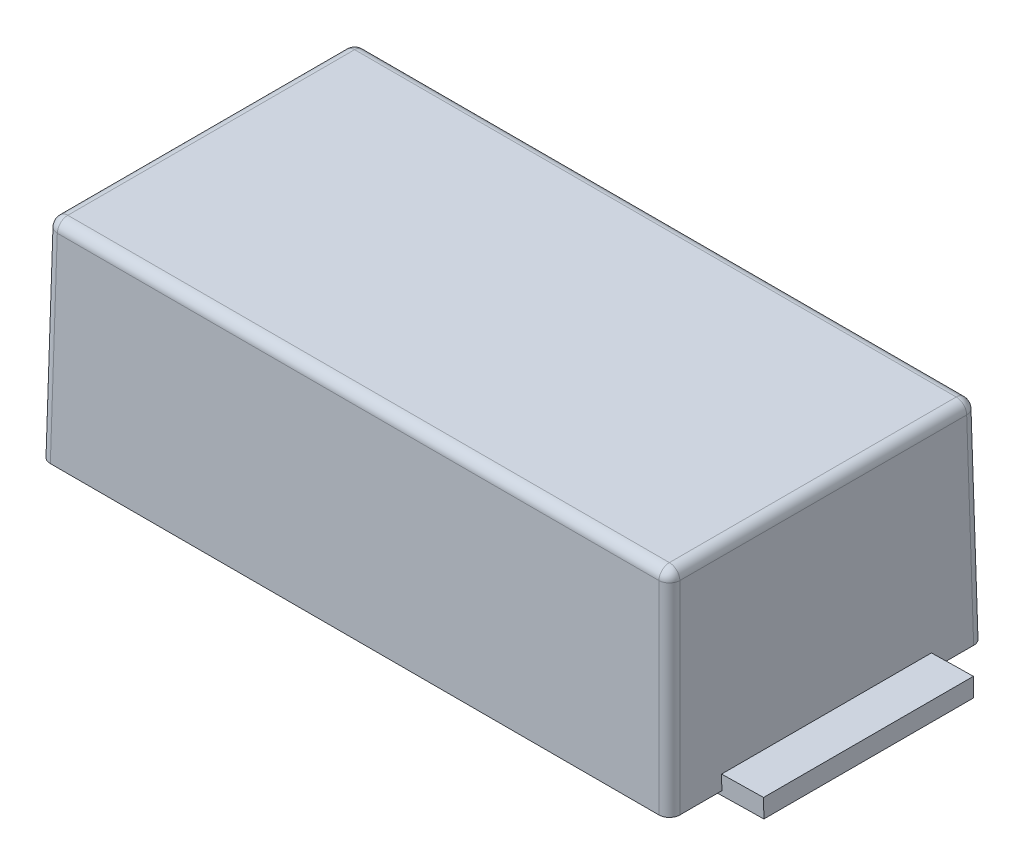
ISO-10303-21;
HEADER;
FILE_DESCRIPTION(('STEP AP214'),'2;1');
FILE_NAME('part.step','',(''),(''),'','','');
FILE_SCHEMA(('AUTOMOTIVE_DESIGN { 1 0 10303 214 1 1 1 1 }'));
ENDSEC;
DATA;
#1=APPLICATION_CONTEXT('core data for automotive mechanical design processes');
#2=APPLICATION_PROTOCOL_DEFINITION('international standard','automotive_design',2000,#1);
#3=PRODUCT_CONTEXT('',#1,'mechanical');
#4=PRODUCT('Part','Part','',(#3));
#5=PRODUCT_RELATED_PRODUCT_CATEGORY('part','',(#4));
#6=PRODUCT_DEFINITION_FORMATION('','',#4);
#7=PRODUCT_DEFINITION_CONTEXT('part definition',#1,'design');
#8=PRODUCT_DEFINITION('design','',#6,#7);
#9=PRODUCT_DEFINITION_SHAPE('','',#8);
#10=(LENGTH_UNIT() NAMED_UNIT(*) SI_UNIT(.MILLI.,.METRE.));
#11=(NAMED_UNIT(*) PLANE_ANGLE_UNIT() SI_UNIT($,.RADIAN.));
#12=(NAMED_UNIT(*) SI_UNIT($,.STERADIAN.) SOLID_ANGLE_UNIT());
#13=UNCERTAINTY_MEASURE_WITH_UNIT(LENGTH_MEASURE(1.E-05),#10,'distance_accuracy_value','');
#14=(GEOMETRIC_REPRESENTATION_CONTEXT(3) GLOBAL_UNCERTAINTY_ASSIGNED_CONTEXT((#13)) GLOBAL_UNIT_ASSIGNED_CONTEXT((#10,
#11,#12)) REPRESENTATION_CONTEXT('',''));
#15=CARTESIAN_POINT('',(0.,0.,0.));
#16=DIRECTION('',(0.,0.,1.));
#17=DIRECTION('',(1.,0.,0.));
#18=AXIS2_PLACEMENT_3D('',#15,#16,#17);
#19=CARTESIAN_POINT('',(0.,0.,0.));
#20=DIRECTION('',(0.,-1.,0.));
#21=DIRECTION('',(0.,0.,-1.));
#22=AXIS2_PLACEMENT_3D('',#19,#20,#21);
#23=PLANE('',#22);
#24=DIRECTION('',(0.,0.,1.));
#25=VECTOR('',#24,1.);
#26=CARTESIAN_POINT('',(-1.5,0.,0.75));
#27=LINE('',#26,#25);
#28=CARTESIAN_POINT('',(-1.5,0.,0.5));
#29=VERTEX_POINT('',#28);
#30=CARTESIAN_POINT('',(-1.5,0.,0.700007615242177));
#31=VERTEX_POINT('',#30);
#32=EDGE_CURVE('E265',#29,#31,#27,.T.);
#33=ORIENTED_EDGE('',*,*,#32,.F.);
#34=DIRECTION('',(1.,0.,0.));
#35=VECTOR('',#34,1.);
#36=CARTESIAN_POINT('',(0.,0.,0.5));
#37=LINE('',#36,#35);
#38=CARTESIAN_POINT('',(-0.999923835978043,0.,0.5));
#39=VERTEX_POINT('',#38);
#40=EDGE_CURVE('E221',#29,#39,#37,.T.);
#41=ORIENTED_EDGE('',*,*,#40,.T.);
#42=DIRECTION('',(0.,0.,-1.));
#43=VECTOR('',#42,1.);
#44=CARTESIAN_POINT('',(-0.999923835978044,0.,0.));
#45=LINE('',#44,#43);
#46=CARTESIAN_POINT('',(-0.999923835978043,0.,-0.5));
#47=VERTEX_POINT('',#46);
#48=EDGE_CURVE('E11',#39,#47,#45,.T.);
#49=ORIENTED_EDGE('',*,*,#48,.T.);
#50=DIRECTION('',(-1.,0.,0.));
#51=VECTOR('',#50,1.);
#52=CARTESIAN_POINT('',(0.,0.,-0.5));
#53=LINE('',#52,#51);
#54=CARTESIAN_POINT('',(-1.5,0.,-0.5));
#55=VERTEX_POINT('',#54);
#56=EDGE_CURVE('E215',#47,#55,#53,.T.);
#57=ORIENTED_EDGE('',*,*,#56,.T.);
#58=CARTESIAN_POINT('',(-1.5,0.,-0.700007615242177));
#59=VERTEX_POINT('',#58);
#60=EDGE_CURVE('E266',#59,#55,#27,.T.);
#61=ORIENTED_EDGE('',*,*,#60,.F.);
#62=CARTESIAN_POINT('',(-1.4499923835978,0.,-0.699992383597801));
#63=DIRECTION('',(0.,-1.,0.));
#64=DIRECTION('',(-0.707106781186545,0.,-0.70710678118655));
#65=AXIS2_PLACEMENT_3D('',#62,#63,#64);
#66=ELLIPSE('',#65,0.0500152316445525,0.05);
#67=CARTESIAN_POINT('',(-1.45000761524218,0.,-0.75));
#68=VERTEX_POINT('',#67);
#69=EDGE_CURVE('E311',#59,#68,#66,.T.);
#70=ORIENTED_EDGE('',*,*,#69,.T.);
#71=DIRECTION('',(-1.,0.,0.));
#72=VECTOR('',#71,1.);
#73=CARTESIAN_POINT('',(-1.5,0.,-0.75));
#74=LINE('',#73,#72);
#75=CARTESIAN_POINT('',(1.45000761524218,0.,-0.75));
#76=VERTEX_POINT('',#75);
#77=EDGE_CURVE('E261',#76,#68,#74,.T.);
#78=ORIENTED_EDGE('',*,*,#77,.F.);
#79=CARTESIAN_POINT('',(1.4499923835978,0.,-0.699992383597801));
#80=DIRECTION('',(0.,-1.,0.));
#81=DIRECTION('',(0.707106781186545,0.,-0.70710678118655));
#82=AXIS2_PLACEMENT_3D('',#79,#80,#81);
#83=ELLIPSE('',#82,0.0500152316445525,0.05);
#84=CARTESIAN_POINT('',(1.5,0.,-0.700007615242177));
#85=VERTEX_POINT('',#84);
#86=EDGE_CURVE('E308',#76,#85,#83,.T.);
#87=ORIENTED_EDGE('',*,*,#86,.T.);
#88=DIRECTION('',(0.,0.,-1.));
#89=VECTOR('',#88,1.);
#90=CARTESIAN_POINT('',(1.5,0.,0.75));
#91=LINE('',#90,#89);
#92=CARTESIAN_POINT('',(1.5,0.,-0.5));
#93=VERTEX_POINT('',#92);
#94=EDGE_CURVE('E262',#93,#85,#91,.T.);
#95=ORIENTED_EDGE('',*,*,#94,.F.);
#96=DIRECTION('',(1.,0.,0.));
#97=VECTOR('',#96,1.);
#98=CARTESIAN_POINT('',(0.,0.,-0.5));
#99=LINE('',#98,#97);
#100=CARTESIAN_POINT('',(0.999923835978044,0.,-0.5));
#101=VERTEX_POINT('',#100);
#102=EDGE_CURVE('E247',#101,#93,#99,.T.);
#103=ORIENTED_EDGE('',*,*,#102,.F.);
#104=DIRECTION('',(0.,0.,1.));
#105=VECTOR('',#104,1.);
#106=CARTESIAN_POINT('',(0.999923835978044,0.,0.));
#107=LINE('',#106,#105);
#108=CARTESIAN_POINT('',(0.999923835978044,0.,0.5));
#109=VERTEX_POINT('',#108);
#110=EDGE_CURVE('E56',#101,#109,#107,.T.);
#111=ORIENTED_EDGE('',*,*,#110,.T.);
#112=DIRECTION('',(-1.,0.,0.));
#113=VECTOR('',#112,1.);
#114=CARTESIAN_POINT('',(0.,0.,0.5));
#115=LINE('',#114,#113);
#116=CARTESIAN_POINT('',(1.5,0.,0.5));
#117=VERTEX_POINT('',#116);
#118=EDGE_CURVE('E255',#117,#109,#115,.T.);
#119=ORIENTED_EDGE('',*,*,#118,.F.);
#120=CARTESIAN_POINT('',(1.5,0.,0.700007615242177));
#121=VERTEX_POINT('',#120);
#122=EDGE_CURVE('E258',#121,#117,#91,.T.);
#123=ORIENTED_EDGE('',*,*,#122,.F.);
#124=CARTESIAN_POINT('',(1.4499923835978,0.,0.699992383597801));
#125=DIRECTION('',(0.,-1.,0.));
#126=DIRECTION('',(-0.707106781186545,0.,-0.70710678118655));
#127=AXIS2_PLACEMENT_3D('',#124,#125,#126);
#128=ELLIPSE('',#127,0.0500152316445525,0.05);
#129=CARTESIAN_POINT('',(1.45000761524218,0.,0.75));
#130=VERTEX_POINT('',#129);
#131=EDGE_CURVE('E306',#121,#130,#128,.T.);
#132=ORIENTED_EDGE('',*,*,#131,.T.);
#133=DIRECTION('',(1.,0.,0.));
#134=VECTOR('',#133,1.);
#135=CARTESIAN_POINT('',(-1.5,0.,0.75));
#136=LINE('',#135,#134);
#137=CARTESIAN_POINT('',(-1.45000761524218,0.,0.75));
#138=VERTEX_POINT('',#137);
#139=EDGE_CURVE('E269',#138,#130,#136,.T.);
#140=ORIENTED_EDGE('',*,*,#139,.F.);
#141=CARTESIAN_POINT('',(-1.4499923835978,0.,0.699992383597801));
#142=DIRECTION('',(0.,-1.,0.));
#143=DIRECTION('',(0.707106781186545,0.,-0.70710678118655));
#144=AXIS2_PLACEMENT_3D('',#141,#142,#143);
#145=ELLIPSE('',#144,0.0500152316445525,0.05);
#146=EDGE_CURVE('E313',#138,#31,#145,.T.);
#147=ORIENTED_EDGE('',*,*,#146,.T.);
#148=EDGE_LOOP('',(#33,#41,#49,#57,#61,#70,#78,#87,#95,#103,#111,#119,#123,#132,#140,#147));
#149=FACE_BOUND('',#148,.T.);
#150=ADVANCED_FACE('F33',(#149),#23,.T.);
#151=CARTESIAN_POINT('',(-1.48254493507178,1.,0.));
#152=DIRECTION('',(0.999847695156391,-0.01745240643728,0.));
#153=DIRECTION('',(0.,0.,1.));
#154=AXIS2_PLACEMENT_3D('',#151,#152,#153);
#155=PLANE('',#154);
#156=DIRECTION('',(0.,0.,-1.));
#157=VECTOR('',#156,1.);
#158=CARTESIAN_POINT('',(-1.49880952804625,0.0682020925527498,0.));
#159=LINE('',#158,#157);
#160=CARTESIAN_POINT('',(-1.49880952804625,0.0682020925527498,-0.5));
#161=VERTEX_POINT('',#160);
#162=CARTESIAN_POINT('',(-1.49880952804625,0.0682020925527498,0.5));
#163=VERTEX_POINT('',#162);
#164=EDGE_CURVE('E359',#161,#163,#159,.F.);
#165=ORIENTED_EDGE('',*,*,#164,.T.);
#166=DIRECTION('',(0.01745240643728,0.999847695156391,0.));
#167=VECTOR('',#166,1.);
#168=CARTESIAN_POINT('',(-1.48254493507178,1.,0.5));
#169=LINE('',#168,#167);
#170=EDGE_CURVE('E41',#163,#29,#169,.F.);
#171=ORIENTED_EDGE('',*,*,#170,.T.);
#172=ORIENTED_EDGE('',*,*,#32,.T.);
#173=DIRECTION('',(-0.0174497491606792,-0.999695459881888,0.0174497491606793));
#174=VECTOR('',#173,1.);
#175=CARTESIAN_POINT('',(-1.48233710208905,1.01190674360623,0.682344717331232));
#176=LINE('',#175,#174);
#177=CARTESIAN_POINT('',(-1.48340245667382,0.950872620321864,0.683410071915998));
#178=VERTEX_POINT('',#177);
#179=EDGE_CURVE('E298',#31,#178,#176,.F.);
#180=ORIENTED_EDGE('',*,*,#179,.T.);
#181=DIRECTION('',(0.,0.,1.));
#182=VECTOR('',#181,1.);
#183=CARTESIAN_POINT('',(-1.48340245667382,0.950872620321864,-0.732544935071783));
#184=LINE('',#183,#182);
#185=CARTESIAN_POINT('',(-1.48340245667382,0.950872620321864,-0.683410071915998));
#186=VERTEX_POINT('',#185);
#187=EDGE_CURVE('E296',#178,#186,#184,.F.);
#188=ORIENTED_EDGE('',*,*,#187,.T.);
#189=DIRECTION('',(0.0174497491606792,0.999695459881888,0.0174497491606793));
#190=VECTOR('',#189,1.);
#191=CARTESIAN_POINT('',(-1.48233710208905,1.01190674360623,-0.682344717331233));
#192=LINE('',#191,#190);
#193=EDGE_CURVE('E294',#186,#59,#192,.F.);
#194=ORIENTED_EDGE('',*,*,#193,.T.);
#195=ORIENTED_EDGE('',*,*,#60,.T.);
#196=DIRECTION('',(-0.01745240643728,-0.999847695156391,0.));
#197=VECTOR('',#196,1.);
#198=CARTESIAN_POINT('',(-1.48254493507178,1.,-0.5));
#199=LINE('',#198,#197);
#200=EDGE_CURVE('E361',#55,#161,#199,.F.);
#201=ORIENTED_EDGE('',*,*,#200,.T.);
#202=EDGE_LOOP('',(#165,#171,#172,#180,#188,#194,#195,#201));
#203=FACE_BOUND('',#202,.T.);
#204=ADVANCED_FACE('F365',(#203),#155,.F.);
#205=CARTESIAN_POINT('',(0.,1.,0.));
#206=DIRECTION('',(0.,-1.,0.));
#207=DIRECTION('',(0.,0.,-1.));
#208=AXIS2_PLACEMENT_3D('',#205,#206,#207);
#209=PLANE('',#208);
#210=DIRECTION('',(-1.,0.,0.));
#211=VECTOR('',#210,1.);
#212=CARTESIAN_POINT('',(1.48254493507178,1.,0.683410071915998));
#213=LINE('',#212,#211);
#214=CARTESIAN_POINT('',(-1.433410071916,1.,0.683410071915998));
#215=VERTEX_POINT('',#214);
#216=CARTESIAN_POINT('',(1.433410071916,1.,0.683410071915998));
#217=VERTEX_POINT('',#216);
#218=EDGE_CURVE('E276',#215,#217,#213,.F.);
#219=ORIENTED_EDGE('',*,*,#218,.T.);
#220=DIRECTION('',(0.,0.,1.));
#221=VECTOR('',#220,1.);
#222=CARTESIAN_POINT('',(1.433410071916,1.,-0.732544935071783));
#223=LINE('',#222,#221);
#224=CARTESIAN_POINT('',(1.433410071916,1.,-0.683410071915998));
#225=VERTEX_POINT('',#224);
#226=EDGE_CURVE('E278',#217,#225,#223,.F.);
#227=ORIENTED_EDGE('',*,*,#226,.T.);
#228=DIRECTION('',(1.,0.,0.));
#229=VECTOR('',#228,1.);
#230=CARTESIAN_POINT('',(-1.48254493507178,1.,-0.683410071915998));
#231=LINE('',#230,#229);
#232=CARTESIAN_POINT('',(-1.433410071916,1.,-0.683410071915998));
#233=VERTEX_POINT('',#232);
#234=EDGE_CURVE('E272',#225,#233,#231,.F.);
#235=ORIENTED_EDGE('',*,*,#234,.T.);
#236=DIRECTION('',(0.,0.,-1.));
#237=VECTOR('',#236,1.);
#238=CARTESIAN_POINT('',(-1.433410071916,1.,0.732544935071782));
#239=LINE('',#238,#237);
#240=EDGE_CURVE('E274',#233,#215,#239,.F.);
#241=ORIENTED_EDGE('',*,*,#240,.T.);
#242=EDGE_LOOP('',(#219,#227,#235,#241));
#243=FACE_BOUND('',#242,.T.);
#244=ADVANCED_FACE('F416',(#243),#209,.F.);
#245=CARTESIAN_POINT('',(1.48254493507178,1.,0.));
#246=DIRECTION('',(-0.999847695156391,-0.01745240643728,0.));
#247=DIRECTION('',(0.,0.,-1.));
#248=AXIS2_PLACEMENT_3D('',#245,#246,#247);
#249=PLANE('',#248);
#250=DIRECTION('',(-0.01745240643728,0.999847695156391,0.));
#251=VECTOR('',#250,1.);
#252=CARTESIAN_POINT('',(1.48254493507178,1.,0.5));
#253=LINE('',#252,#251);
#254=CARTESIAN_POINT('',(1.49880952804625,0.0682020925527498,0.5));
#255=VERTEX_POINT('',#254);
#256=EDGE_CURVE('E355',#255,#117,#253,.F.);
#257=ORIENTED_EDGE('',*,*,#256,.F.);
#258=DIRECTION('',(0.,0.,-1.));
#259=VECTOR('',#258,1.);
#260=CARTESIAN_POINT('',(1.49880952804625,0.0682020925527498,0.));
#261=LINE('',#260,#259);
#262=CARTESIAN_POINT('',(1.49880952804625,0.0682020925527498,-0.5));
#263=VERTEX_POINT('',#262);
#264=EDGE_CURVE('E352',#263,#255,#261,.F.);
#265=ORIENTED_EDGE('',*,*,#264,.F.);
#266=DIRECTION('',(0.01745240643728,-0.999847695156391,0.));
#267=VECTOR('',#266,1.);
#268=CARTESIAN_POINT('',(1.48254493507178,1.,-0.5));
#269=LINE('',#268,#267);
#270=EDGE_CURVE('E316',#93,#263,#269,.F.);
#271=ORIENTED_EDGE('',*,*,#270,.F.);
#272=ORIENTED_EDGE('',*,*,#94,.T.);
#273=DIRECTION('',(-0.0174497491606792,0.999695459881888,0.0174497491606793));
#274=VECTOR('',#273,1.);
#275=CARTESIAN_POINT('',(1.48233710208905,1.01190674360623,-0.682344717331233));
#276=LINE('',#275,#274);
#277=CARTESIAN_POINT('',(1.48340245667382,0.950872620321864,-0.683410071915998));
#278=VERTEX_POINT('',#277);
#279=EDGE_CURVE('E286',#85,#278,#276,.T.);
#280=ORIENTED_EDGE('',*,*,#279,.T.);
#281=DIRECTION('',(0.,0.,-1.));
#282=VECTOR('',#281,1.);
#283=CARTESIAN_POINT('',(1.48340245667382,0.950872620321864,0.732544935071782));
#284=LINE('',#283,#282);
#285=CARTESIAN_POINT('',(1.48340245667382,0.950872620321864,0.683410071915998));
#286=VERTEX_POINT('',#285);
#287=EDGE_CURVE('E283',#278,#286,#284,.F.);
#288=ORIENTED_EDGE('',*,*,#287,.T.);
#289=DIRECTION('',(0.0174497491606792,-0.999695459881888,0.0174497491606793));
#290=VECTOR('',#289,1.);
#291=CARTESIAN_POINT('',(1.48233710208905,1.01190674360623,0.682344717331232));
#292=LINE('',#291,#290);
#293=EDGE_CURVE('E281',#286,#121,#292,.T.);
#294=ORIENTED_EDGE('',*,*,#293,.T.);
#295=ORIENTED_EDGE('',*,*,#122,.T.);
#296=EDGE_LOOP('',(#257,#265,#271,#272,#280,#288,#294,#295));
#297=FACE_BOUND('',#296,.T.);
#298=ADVANCED_FACE('F428',(#297),#249,.F.);
#299=CARTESIAN_POINT('',(0.,1.,-0.732544935071783));
#300=DIRECTION('',(0.,-0.0174524064372801,0.999847695156391));
#301=DIRECTION('',(-1.,0.,0.));
#302=AXIS2_PLACEMENT_3D('',#299,#300,#301);
#303=PLANE('',#302);
#304=ORIENTED_EDGE('',*,*,#77,.T.);
#305=DIRECTION('',(0.0174497491606792,0.999695459881888,0.0174497491606793));
#306=VECTOR('',#305,1.);
#307=CARTESIAN_POINT('',(-1.4321163470219,1.02499006986524,-0.732108731779724));
#308=LINE('',#307,#306);
#309=CARTESIAN_POINT('',(-1.433410071916,0.950872620321864,-0.733402456673818));
#310=VERTEX_POINT('',#309);
#311=EDGE_CURVE('E304',#68,#310,#308,.T.);
#312=ORIENTED_EDGE('',*,*,#311,.T.);
#313=DIRECTION('',(-1.,0.,0.));
#314=VECTOR('',#313,1.);
#315=CARTESIAN_POINT('',(1.48254493507178,0.950872620321864,-0.733402456673818));
#316=LINE('',#315,#314);
#317=CARTESIAN_POINT('',(1.433410071916,0.950872620321864,-0.733402456673818));
#318=VERTEX_POINT('',#317);
#319=EDGE_CURVE('E302',#310,#318,#316,.F.);
#320=ORIENTED_EDGE('',*,*,#319,.T.);
#321=DIRECTION('',(-0.0174497491606792,0.999695459881888,0.0174497491606793));
#322=VECTOR('',#321,1.);
#323=CARTESIAN_POINT('',(1.4321163470219,1.02499006986524,-0.732108731779724));
#324=LINE('',#323,#322);
#325=EDGE_CURVE('E300',#318,#76,#324,.F.);
#326=ORIENTED_EDGE('',*,*,#325,.T.);
#327=EDGE_LOOP('',(#304,#312,#320,#326));
#328=FACE_BOUND('',#327,.T.);
#329=ADVANCED_FACE('F424',(#328),#303,.F.);
#330=CARTESIAN_POINT('',(0.,1.,0.732544935071782));
#331=DIRECTION('',(0.,-0.0174524064372801,-0.999847695156391));
#332=DIRECTION('',(1.,0.,0.));
#333=AXIS2_PLACEMENT_3D('',#330,#331,#332);
#334=PLANE('',#333);
#335=DIRECTION('',(1.,0.,0.));
#336=VECTOR('',#335,1.);
#337=CARTESIAN_POINT('',(-1.48254493507178,0.950872620321864,0.733402456673817));
#338=LINE('',#337,#336);
#339=CARTESIAN_POINT('',(1.433410071916,0.950872620321864,0.733402456673817));
#340=VERTEX_POINT('',#339);
#341=CARTESIAN_POINT('',(-1.433410071916,0.950872620321864,0.733402456673817));
#342=VERTEX_POINT('',#341);
#343=EDGE_CURVE('E290',#340,#342,#338,.F.);
#344=ORIENTED_EDGE('',*,*,#343,.T.);
#345=DIRECTION('',(-0.0174497491606792,-0.999695459881888,0.0174497491606793));
#346=VECTOR('',#345,1.);
#347=CARTESIAN_POINT('',(-1.4321163470219,1.02499006986524,0.732108731779724));
#348=LINE('',#347,#346);
#349=EDGE_CURVE('E292',#342,#138,#348,.T.);
#350=ORIENTED_EDGE('',*,*,#349,.T.);
#351=ORIENTED_EDGE('',*,*,#139,.T.);
#352=DIRECTION('',(0.0174497491606792,-0.999695459881888,0.0174497491606793));
#353=VECTOR('',#352,1.);
#354=CARTESIAN_POINT('',(1.4321163470219,1.02499006986524,0.732108731779724));
#355=LINE('',#354,#353);
#356=EDGE_CURVE('E288',#130,#340,#355,.F.);
#357=ORIENTED_EDGE('',*,*,#356,.T.);
#358=EDGE_LOOP('',(#344,#350,#351,#357));
#359=FACE_BOUND('',#358,.T.);
#360=ADVANCED_FACE('F421',(#359),#334,.F.);
#361=CARTESIAN_POINT('',(-1.43234471733123,1.01103412328437,0.682344717331232));
#362=DIRECTION('',(0.0174497491606792,0.999695459881888,-0.0174497491606793));
#363=DIRECTION('',(0.,0.0174524064372801,0.999847695156391));
#364=AXIS2_PLACEMENT_3D('',#361,#362,#363);
#365=CYLINDRICAL_SURFACE('',#364,0.05);
#366=ORIENTED_EDGE('',*,*,#146,.F.);
#367=ORIENTED_EDGE('',*,*,#349,.F.);
#368=CARTESIAN_POINT('',(-1.433410071916,0.95,0.683410071915998));
#369=DIRECTION('',(0.01744974916068,0.999695459881888,-0.01744974916068));
#370=DIRECTION('',(0.,0.0174524064372809,0.999847695156391));
#371=AXIS2_PLACEMENT_3D('',#368,#369,#370);
#372=CIRCLE('',#371,0.05);
#373=EDGE_CURVE('E347',#178,#342,#372,.T.);
#374=ORIENTED_EDGE('',*,*,#373,.F.);
#375=ORIENTED_EDGE('',*,*,#179,.F.);
#376=EDGE_LOOP('',(#366,#367,#374,#375));
#377=FACE_BOUND('',#376,.T.);
#378=ADVANCED_FACE('F35',(#377),#365,.T.);
#379=CARTESIAN_POINT('',(-1.433410071916,0.95,0.));
#380=DIRECTION('',(0.,0.,1.));
#381=DIRECTION('',(1.,0.,0.));
#382=AXIS2_PLACEMENT_3D('',#379,#380,#381);
#383=CYLINDRICAL_SURFACE('',#382,0.05);
#384=CARTESIAN_POINT('',(-1.433410071916,0.95,-0.683410071915998));
#385=DIRECTION('',(0.,0.,-1.));
#386=DIRECTION('',(0.,1.,0.));
#387=AXIS2_PLACEMENT_3D('',#384,#385,#386);
#388=CIRCLE('',#387,0.05);
#389=EDGE_CURVE('E341',#186,#233,#388,.T.);
#390=ORIENTED_EDGE('',*,*,#389,.F.);
#391=ORIENTED_EDGE('',*,*,#187,.F.);
#392=CARTESIAN_POINT('',(-1.433410071916,0.95,0.683410071915998));
#393=DIRECTION('',(0.,0.,1.));
#394=DIRECTION('',(1.,0.,0.));
#395=AXIS2_PLACEMENT_3D('',#392,#393,#394);
#396=CIRCLE('',#395,0.05);
#397=EDGE_CURVE('E344',#215,#178,#396,.T.);
#398=ORIENTED_EDGE('',*,*,#397,.F.);
#399=ORIENTED_EDGE('',*,*,#240,.F.);
#400=EDGE_LOOP('',(#390,#391,#398,#399));
#401=FACE_BOUND('',#400,.T.);
#402=ADVANCED_FACE('F377',(#401),#383,.T.);
#403=CARTESIAN_POINT('',(-1.43234471733123,1.01103412328437,-0.682344717331233));
#404=DIRECTION('',(-0.0174497491606792,-0.999695459881888,-0.0174497491606793));
#405=DIRECTION('',(0.,0.0174524064372801,-0.999847695156391));
#406=AXIS2_PLACEMENT_3D('',#403,#404,#405);
#407=CYLINDRICAL_SURFACE('',#406,0.05);
#408=ORIENTED_EDGE('',*,*,#69,.F.);
#409=ORIENTED_EDGE('',*,*,#193,.F.);
#410=CARTESIAN_POINT('',(-1.433410071916,0.95,-0.683410071915998));
#411=DIRECTION('',(0.0174497491606799,0.999695459881888,0.01744974916068));
#412=DIRECTION('',(0.,-0.0174524064372808,0.999847695156391));
#413=AXIS2_PLACEMENT_3D('',#410,#411,#412);
#414=CIRCLE('',#413,0.05);
#415=EDGE_CURVE('E338',#310,#186,#414,.T.);
#416=ORIENTED_EDGE('',*,*,#415,.F.);
#417=ORIENTED_EDGE('',*,*,#311,.F.);
#418=EDGE_LOOP('',(#408,#409,#416,#417));
#419=FACE_BOUND('',#418,.T.);
#420=ADVANCED_FACE('F388',(#419),#407,.T.);
#421=CARTESIAN_POINT('',(-1.433410071916,0.95,0.683410071915998));
#422=DIRECTION('',(0.,0.,1.));
#423=DIRECTION('',(1.,0.,0.));
#424=AXIS2_PLACEMENT_3D('',#421,#422,#423);
#425=SPHERICAL_SURFACE('',#424,0.05);
#426=ORIENTED_EDGE('',*,*,#397,.T.);
#427=ORIENTED_EDGE('',*,*,#373,.T.);
#428=CARTESIAN_POINT('',(-1.433410071916,0.95,0.683410071915998));
#429=DIRECTION('',(-1.,0.,0.));
#430=DIRECTION('',(0.,-1.,0.));
#431=AXIS2_PLACEMENT_3D('',#428,#429,#430);
#432=CIRCLE('',#431,0.05);
#433=EDGE_CURVE('E335',#215,#342,#432,.F.);
#434=ORIENTED_EDGE('',*,*,#433,.F.);
#435=EDGE_LOOP('',(#426,#427,#434));
#436=FACE_BOUND('',#435,.T.);
#437=ADVANCED_FACE('F464',(#436),#425,.T.);
#438=CARTESIAN_POINT('',(-1.433410071916,0.95,-0.683410071915998));
#439=DIRECTION('',(0.,0.,1.));
#440=DIRECTION('',(1.,0.,0.));
#441=AXIS2_PLACEMENT_3D('',#438,#439,#440);
#442=SPHERICAL_SURFACE('',#441,0.05);
#443=ORIENTED_EDGE('',*,*,#415,.T.);
#444=ORIENTED_EDGE('',*,*,#389,.T.);
#445=CARTESIAN_POINT('',(-1.433410071916,0.95,-0.683410071915998));
#446=DIRECTION('',(-1.,0.,0.));
#447=DIRECTION('',(0.,0.,1.));
#448=AXIS2_PLACEMENT_3D('',#445,#446,#447);
#449=CIRCLE('',#448,0.05);
#450=EDGE_CURVE('E332',#310,#233,#449,.F.);
#451=ORIENTED_EDGE('',*,*,#450,.F.);
#452=EDGE_LOOP('',(#443,#444,#451));
#453=FACE_BOUND('',#452,.T.);
#454=ADVANCED_FACE('F383',(#453),#442,.T.);
#455=CARTESIAN_POINT('',(1.4321163470219,1.02411744954338,0.682116347021904));
#456=DIRECTION('',(-0.0174497491606792,0.999695459881888,-0.0174497491606793));
#457=DIRECTION('',(0.,0.0174524064372801,0.999847695156391));
#458=AXIS2_PLACEMENT_3D('',#455,#456,#457);
#459=CYLINDRICAL_SURFACE('',#458,0.05);
#460=ORIENTED_EDGE('',*,*,#131,.F.);
#461=ORIENTED_EDGE('',*,*,#293,.F.);
#462=CARTESIAN_POINT('',(1.433410071916,0.95,0.683410071915998));
#463=DIRECTION('',(-0.0174497491606799,0.999695459881888,-0.01744974916068));
#464=DIRECTION('',(0.,0.0174524064372808,0.999847695156391));
#465=AXIS2_PLACEMENT_3D('',#462,#463,#464);
#466=CIRCLE('',#465,0.05);
#467=EDGE_CURVE('E329',#340,#286,#466,.T.);
#468=ORIENTED_EDGE('',*,*,#467,.F.);
#469=ORIENTED_EDGE('',*,*,#356,.F.);
#470=EDGE_LOOP('',(#460,#461,#468,#469));
#471=FACE_BOUND('',#470,.T.);
#472=ADVANCED_FACE('F457',(#471),#459,.T.);
#473=CARTESIAN_POINT('',(0.,0.95,0.683410071915998));
#474=DIRECTION('',(1.,0.,0.));
#475=DIRECTION('',(0.,0.,-1.));
#476=AXIS2_PLACEMENT_3D('',#473,#474,#475);
#477=CYLINDRICAL_SURFACE('',#476,0.05);
#478=ORIENTED_EDGE('',*,*,#433,.T.);
#479=ORIENTED_EDGE('',*,*,#343,.F.);
#480=CARTESIAN_POINT('',(1.433410071916,0.95,0.683410071915998));
#481=DIRECTION('',(1.,0.,0.));
#482=DIRECTION('',(0.,0.,-1.));
#483=AXIS2_PLACEMENT_3D('',#480,#481,#482);
#484=CIRCLE('',#483,0.05);
#485=EDGE_CURVE('E326',#217,#340,#484,.T.);
#486=ORIENTED_EDGE('',*,*,#485,.F.);
#487=ORIENTED_EDGE('',*,*,#218,.F.);
#488=EDGE_LOOP('',(#478,#479,#486,#487));
#489=FACE_BOUND('',#488,.T.);
#490=ADVANCED_FACE('F453',(#489),#477,.T.);
#491=CARTESIAN_POINT('',(0.,0.95,-0.683410071915998));
#492=DIRECTION('',(-1.,0.,0.));
#493=DIRECTION('',(0.,0.,1.));
#494=AXIS2_PLACEMENT_3D('',#491,#492,#493);
#495=CYLINDRICAL_SURFACE('',#494,0.05);
#496=ORIENTED_EDGE('',*,*,#450,.T.);
#497=ORIENTED_EDGE('',*,*,#234,.F.);
#498=CARTESIAN_POINT('',(1.433410071916,0.95,-0.683410071915998));
#499=DIRECTION('',(1.,0.,0.));
#500=DIRECTION('',(0.,1.,0.));
#501=AXIS2_PLACEMENT_3D('',#498,#499,#500);
#502=CIRCLE('',#501,0.05);
#503=EDGE_CURVE('E323',#318,#225,#502,.T.);
#504=ORIENTED_EDGE('',*,*,#503,.F.);
#505=ORIENTED_EDGE('',*,*,#319,.F.);
#506=EDGE_LOOP('',(#496,#497,#504,#505));
#507=FACE_BOUND('',#506,.T.);
#508=ADVANCED_FACE('F449',(#507),#495,.T.);
#509=CARTESIAN_POINT('',(1.4321163470219,1.02411744954338,-0.682116347021905));
#510=DIRECTION('',(0.0174497491606792,-0.999695459881888,-0.0174497491606793));
#511=DIRECTION('',(0.,0.0174524064372801,-0.999847695156391));
#512=AXIS2_PLACEMENT_3D('',#509,#510,#511);
#513=CYLINDRICAL_SURFACE('',#512,0.05);
#514=ORIENTED_EDGE('',*,*,#86,.F.);
#515=ORIENTED_EDGE('',*,*,#325,.F.);
#516=CARTESIAN_POINT('',(1.433410071916,0.95,-0.683410071915998));
#517=DIRECTION('',(-0.01744974916068,0.999695459881888,0.01744974916068));
#518=DIRECTION('',(0.,-0.0174524064372809,0.999847695156391));
#519=AXIS2_PLACEMENT_3D('',#516,#517,#518);
#520=CIRCLE('',#519,0.05);
#521=EDGE_CURVE('E320',#278,#318,#520,.T.);
#522=ORIENTED_EDGE('',*,*,#521,.F.);
#523=ORIENTED_EDGE('',*,*,#279,.F.);
#524=EDGE_LOOP('',(#514,#515,#522,#523));
#525=FACE_BOUND('',#524,.T.);
#526=ADVANCED_FACE('F445',(#525),#513,.T.);
#527=CARTESIAN_POINT('',(1.433410071916,0.95,0.683410071915998));
#528=DIRECTION('',(0.,0.,1.));
#529=DIRECTION('',(1.,0.,0.));
#530=AXIS2_PLACEMENT_3D('',#527,#528,#529);
#531=SPHERICAL_SURFACE('',#530,0.05);
#532=ORIENTED_EDGE('',*,*,#485,.T.);
#533=ORIENTED_EDGE('',*,*,#467,.T.);
#534=CARTESIAN_POINT('',(1.433410071916,0.95,0.683410071915998));
#535=DIRECTION('',(0.,0.,1.));
#536=DIRECTION('',(1.,0.,0.));
#537=AXIS2_PLACEMENT_3D('',#534,#535,#536);
#538=CIRCLE('',#537,0.05);
#539=EDGE_CURVE('E318',#217,#286,#538,.F.);
#540=ORIENTED_EDGE('',*,*,#539,.F.);
#541=EDGE_LOOP('',(#532,#533,#540));
#542=FACE_BOUND('',#541,.T.);
#543=ADVANCED_FACE('F441',(#542),#531,.T.);
#544=CARTESIAN_POINT('',(1.433410071916,0.95,-0.683410071915998));
#545=DIRECTION('',(0.,0.,1.));
#546=DIRECTION('',(1.,0.,0.));
#547=AXIS2_PLACEMENT_3D('',#544,#545,#546);
#548=SPHERICAL_SURFACE('',#547,0.05);
#549=ORIENTED_EDGE('',*,*,#521,.T.);
#550=ORIENTED_EDGE('',*,*,#503,.T.);
#551=CARTESIAN_POINT('',(1.433410071916,0.95,-0.683410071915998));
#552=DIRECTION('',(0.,0.,-1.));
#553=DIRECTION('',(-1.,0.,0.));
#554=AXIS2_PLACEMENT_3D('',#551,#552,#553);
#555=CIRCLE('',#554,0.05);
#556=EDGE_CURVE('E257',#278,#225,#555,.F.);
#557=ORIENTED_EDGE('',*,*,#556,.F.);
#558=EDGE_LOOP('',(#549,#550,#557));
#559=FACE_BOUND('',#558,.T.);
#560=ADVANCED_FACE('F437',(#559),#548,.T.);
#561=CARTESIAN_POINT('',(1.433410071916,0.95,0.));
#562=DIRECTION('',(0.,0.,-1.));
#563=DIRECTION('',(-1.,0.,0.));
#564=AXIS2_PLACEMENT_3D('',#561,#562,#563);
#565=CYLINDRICAL_SURFACE('',#564,0.05);
#566=ORIENTED_EDGE('',*,*,#539,.T.);
#567=ORIENTED_EDGE('',*,*,#287,.F.);
#568=ORIENTED_EDGE('',*,*,#556,.T.);
#569=ORIENTED_EDGE('',*,*,#226,.F.);
#570=EDGE_LOOP('',(#566,#567,#568,#569));
#571=FACE_BOUND('',#570,.T.);
#572=ADVANCED_FACE('F433',(#571),#565,.T.);
#573=CARTESIAN_POINT('',(0.998885680468053,0.0594758893341098,0.5));
#574=DIRECTION('',(0.,0.,1.));
#575=DIRECTION('',(1.,0.,0.));
#576=AXIS2_PLACEMENT_3D('',#573,#574,#575);
#577=PLANE('',#576);
#578=ORIENTED_EDGE('',*,*,#256,.T.);
#579=ORIENTED_EDGE('',*,*,#118,.T.);
#580=DIRECTION('',(0.0174524064372791,-0.999847695156391,0.));
#581=VECTOR('',#580,1.);
#582=CARTESIAN_POINT('',(0.998885680468053,0.0594758893341098,0.5));
#583=LINE('',#582,#581);
#584=CARTESIAN_POINT('',(1.00042520055055,-0.0287231571217679,0.5));
#585=VERTEX_POINT('',#584);
#586=EDGE_CURVE('E236',#109,#585,#583,.T.);
#587=ORIENTED_EDGE('',*,*,#586,.T.);
#588=DIRECTION('',(0.999847695156391,0.01745240643728,0.));
#589=VECTOR('',#588,1.);
#590=CARTESIAN_POINT('',(1.00042520055055,-0.0287231571217679,0.5));
#591=LINE('',#590,#589);
#592=CARTESIAN_POINT('',(1.70031858716002,-0.0165064726156719,0.5));
#593=VERTEX_POINT('',#592);
#594=EDGE_CURVE('E244',#585,#593,#591,.T.);
#595=ORIENTED_EDGE('',*,*,#594,.T.);
#596=DIRECTION('',(0.0174524064372791,-0.999847695156391,0.));
#597=VECTOR('',#596,1.);
#598=CARTESIAN_POINT('',(1.69877906707753,0.0716925738402058,0.5));
#599=LINE('',#598,#597);
#600=CARTESIAN_POINT('',(1.69877906707753,0.0716925738402058,0.5));
#601=VERTEX_POINT('',#600);
#602=EDGE_CURVE('E224',#601,#593,#599,.T.);
#603=ORIENTED_EDGE('',*,*,#602,.F.);
#604=DIRECTION('',(0.999847695156391,0.01745240643728,0.));
#605=VECTOR('',#604,1.);
#606=CARTESIAN_POINT('',(0.998885680468053,0.0594758893341098,0.5));
#607=LINE('',#606,#605);
#608=EDGE_CURVE('E245',#255,#601,#607,.T.);
#609=ORIENTED_EDGE('',*,*,#608,.F.);
#610=EDGE_LOOP('',(#578,#579,#587,#595,#603,#609));
#611=FACE_BOUND('',#610,.T.);
#612=ADVANCED_FACE('F436',(#611),#577,.T.);
#613=CARTESIAN_POINT('',(0.998885680468053,0.0594758893341098,0.5));
#614=DIRECTION('',(-0.01745240643728,0.999847695156391,0.));
#615=DIRECTION('',(-0.999847695156391,-0.01745240643728,0.));
#616=AXIS2_PLACEMENT_3D('',#613,#614,#615);
#617=PLANE('',#616);
#618=DIRECTION('',(0.999847695156391,0.01745240643728,0.));
#619=VECTOR('',#618,1.);
#620=CARTESIAN_POINT('',(0.998885680468053,0.0594758893341098,-0.5));
#621=LINE('',#620,#619);
#622=CARTESIAN_POINT('',(1.69877906707753,0.0716925738402058,-0.5));
#623=VERTEX_POINT('',#622);
#624=EDGE_CURVE('E248',#263,#623,#621,.T.);
#625=ORIENTED_EDGE('',*,*,#624,.F.);
#626=ORIENTED_EDGE('',*,*,#264,.T.);
#627=ORIENTED_EDGE('',*,*,#608,.T.);
#628=DIRECTION('',(0.,0.,1.));
#629=VECTOR('',#628,1.);
#630=CARTESIAN_POINT('',(1.69877906707753,0.0716925738402058,0.5));
#631=LINE('',#630,#629);
#632=EDGE_CURVE('E233',#623,#601,#631,.T.);
#633=ORIENTED_EDGE('',*,*,#632,.F.);
#634=EDGE_LOOP('',(#625,#626,#627,#633));
#635=FACE_BOUND('',#634,.T.);
#636=ADVANCED_FACE('F555',(#635),#617,.T.);
#637=CARTESIAN_POINT('',(0.998885680468053,0.0594758893341098,-0.5));
#638=DIRECTION('',(0.,0.,-1.));
#639=DIRECTION('',(-1.,0.,0.));
#640=AXIS2_PLACEMENT_3D('',#637,#638,#639);
#641=PLANE('',#640);
#642=DIRECTION('',(-0.0174524064372791,0.999847695156391,0.));
#643=VECTOR('',#642,1.);
#644=CARTESIAN_POINT('',(0.998885680468053,0.0594758893341098,-0.5));
#645=LINE('',#644,#643);
#646=CARTESIAN_POINT('',(1.00042520055055,-0.0287231571217679,-0.5));
#647=VERTEX_POINT('',#646);
#648=EDGE_CURVE('E241',#647,#101,#645,.T.);
#649=ORIENTED_EDGE('',*,*,#648,.T.);
#650=ORIENTED_EDGE('',*,*,#102,.T.);
#651=ORIENTED_EDGE('',*,*,#270,.T.);
#652=ORIENTED_EDGE('',*,*,#624,.T.);
#653=DIRECTION('',(-0.0174524064372791,0.999847695156391,0.));
#654=VECTOR('',#653,1.);
#655=CARTESIAN_POINT('',(1.69877906707753,0.0716925738402058,-0.5));
#656=LINE('',#655,#654);
#657=CARTESIAN_POINT('',(1.70031858716002,-0.0165064726156719,-0.5));
#658=VERTEX_POINT('',#657);
#659=EDGE_CURVE('E230',#658,#623,#656,.T.);
#660=ORIENTED_EDGE('',*,*,#659,.F.);
#661=DIRECTION('',(0.999847695156391,0.01745240643728,0.));
#662=VECTOR('',#661,1.);
#663=CARTESIAN_POINT('',(1.00042520055055,-0.0287231571217679,-0.5));
#664=LINE('',#663,#662);
#665=EDGE_CURVE('E250',#647,#658,#664,.T.);
#666=ORIENTED_EDGE('',*,*,#665,.F.);
#667=EDGE_LOOP('',(#649,#650,#651,#652,#660,#666));
#668=FACE_BOUND('',#667,.T.);
#669=ADVANCED_FACE('F558',(#668),#641,.T.);
#670=CARTESIAN_POINT('',(1.00042520055055,-0.0287231571217679,0.5));
#671=DIRECTION('',(0.01745240643728,-0.999847695156391,0.));
#672=DIRECTION('',(0.999847695156391,0.01745240643728,0.));
#673=AXIS2_PLACEMENT_3D('',#670,#671,#672);
#674=PLANE('',#673);
#675=ORIENTED_EDGE('',*,*,#665,.T.);
#676=DIRECTION('',(0.,0.,-1.));
#677=VECTOR('',#676,1.);
#678=CARTESIAN_POINT('',(1.70031858716002,-0.0165064726156719,0.5));
#679=LINE('',#678,#677);
#680=EDGE_CURVE('E227',#593,#658,#679,.T.);
#681=ORIENTED_EDGE('',*,*,#680,.F.);
#682=ORIENTED_EDGE('',*,*,#594,.F.);
#683=DIRECTION('',(0.,0.,-1.));
#684=VECTOR('',#683,1.);
#685=CARTESIAN_POINT('',(1.00042520055055,-0.0287231571217679,0.5));
#686=LINE('',#685,#684);
#687=EDGE_CURVE('E238',#585,#647,#686,.T.);
#688=ORIENTED_EDGE('',*,*,#687,.T.);
#689=EDGE_LOOP('',(#675,#681,#682,#688));
#690=FACE_BOUND('',#689,.T.);
#691=ADVANCED_FACE('F553',(#690),#674,.T.);
#692=CARTESIAN_POINT('',(0.999619272686124,0.0174484193082291,0.));
#693=DIRECTION('',(0.999847695156391,0.0174524064372791,0.));
#694=DIRECTION('',(-0.0174524064372791,0.999847695156391,0.));
#695=AXIS2_PLACEMENT_3D('',#692,#693,#694);
#696=PLANE('',#695);
#697=ORIENTED_EDGE('',*,*,#110,.F.);
#698=ORIENTED_EDGE('',*,*,#648,.F.);
#699=ORIENTED_EDGE('',*,*,#687,.F.);
#700=ORIENTED_EDGE('',*,*,#586,.F.);
#701=EDGE_LOOP('',(#697,#698,#699,#700));
#702=FACE_BOUND('',#701,.T.);
#703=ADVANCED_FACE('F549',(#702),#696,.F.);
#704=CARTESIAN_POINT('',(1.6995126592956,0.0296651038143251,0.));
#705=DIRECTION('',(0.999847695156391,0.0174524064372791,0.));
#706=DIRECTION('',(-0.0174524064372791,0.999847695156391,0.));
#707=AXIS2_PLACEMENT_3D('',#704,#705,#706);
#708=PLANE('',#707);
#709=ORIENTED_EDGE('',*,*,#602,.T.);
#710=ORIENTED_EDGE('',*,*,#680,.T.);
#711=ORIENTED_EDGE('',*,*,#659,.T.);
#712=ORIENTED_EDGE('',*,*,#632,.T.);
#713=EDGE_LOOP('',(#709,#710,#711,#712));
#714=FACE_BOUND('',#713,.T.);
#715=ADVANCED_FACE('F408',(#714),#708,.T.);
#716=CARTESIAN_POINT('',(-0.998885680468053,0.0594758893341098,0.5));
#717=DIRECTION('',(0.,0.,-1.));
#718=DIRECTION('',(-1.,0.,0.));
#719=AXIS2_PLACEMENT_3D('',#716,#717,#718);
#720=PLANE('',#719);
#721=ORIENTED_EDGE('',*,*,#40,.F.);
#722=ORIENTED_EDGE('',*,*,#170,.F.);
#723=DIRECTION('',(-0.999847695156391,0.01745240643728,0.));
#724=VECTOR('',#723,1.);
#725=CARTESIAN_POINT('',(-0.998885680468053,0.0594758893341098,0.5));
#726=LINE('',#725,#724);
#727=CARTESIAN_POINT('',(-1.69877906707753,0.0716925738402058,0.5));
#728=VERTEX_POINT('',#727);
#729=EDGE_CURVE('E48',#163,#728,#726,.T.);
#730=ORIENTED_EDGE('',*,*,#729,.T.);
#731=DIRECTION('',(-0.0174524064372791,-0.999847695156391,0.));
#732=VECTOR('',#731,1.);
#733=CARTESIAN_POINT('',(-1.69877906707753,0.0716925738402058,0.5));
#734=LINE('',#733,#732);
#735=CARTESIAN_POINT('',(-1.70031858716002,-0.0165064726156719,0.5));
#736=VERTEX_POINT('',#735);
#737=EDGE_CURVE('E184',#728,#736,#734,.T.);
#738=ORIENTED_EDGE('',*,*,#737,.T.);
#739=DIRECTION('',(-0.999847695156391,0.01745240643728,0.));
#740=VECTOR('',#739,1.);
#741=CARTESIAN_POINT('',(-1.00042520055055,-0.0287231571217679,0.5));
#742=LINE('',#741,#740);
#743=CARTESIAN_POINT('',(-1.00042520055055,-0.0287231571217679,0.5));
#744=VERTEX_POINT('',#743);
#745=EDGE_CURVE('E213',#744,#736,#742,.T.);
#746=ORIENTED_EDGE('',*,*,#745,.F.);
#747=DIRECTION('',(-0.0174524064372791,-0.999847695156391,0.));
#748=VECTOR('',#747,1.);
#749=CARTESIAN_POINT('',(-0.998885680468053,0.0594758893341098,0.5));
#750=LINE('',#749,#748);
#751=EDGE_CURVE('E207',#39,#744,#750,.T.);
#752=ORIENTED_EDGE('',*,*,#751,.F.);
#753=EDGE_LOOP('',(#721,#722,#730,#738,#746,#752));
#754=FACE_BOUND('',#753,.T.);
#755=ADVANCED_FACE('F182',(#754),#720,.F.);
#756=CARTESIAN_POINT('',(-1.00042520055055,-0.0287231571217679,0.5));
#757=DIRECTION('',(0.01745240643728,0.999847695156391,0.));
#758=DIRECTION('',(-0.999847695156391,0.01745240643728,0.));
#759=AXIS2_PLACEMENT_3D('',#756,#757,#758);
#760=PLANE('',#759);
#761=ORIENTED_EDGE('',*,*,#745,.T.);
#762=DIRECTION('',(0.,0.,-1.));
#763=VECTOR('',#762,1.);
#764=CARTESIAN_POINT('',(-1.70031858716002,-0.0165064726156719,0.5));
#765=LINE('',#764,#763);
#766=CARTESIAN_POINT('',(-1.70031858716002,-0.0165064726156719,-0.5));
#767=VERTEX_POINT('',#766);
#768=EDGE_CURVE('E198',#736,#767,#765,.T.);
#769=ORIENTED_EDGE('',*,*,#768,.T.);
#770=DIRECTION('',(-0.999847695156391,0.01745240643728,0.));
#771=VECTOR('',#770,1.);
#772=CARTESIAN_POINT('',(-1.00042520055055,-0.0287231571217679,-0.5));
#773=LINE('',#772,#771);
#774=CARTESIAN_POINT('',(-1.00042520055055,-0.0287231571217679,-0.5));
#775=VERTEX_POINT('',#774);
#776=EDGE_CURVE('E216',#775,#767,#773,.T.);
#777=ORIENTED_EDGE('',*,*,#776,.F.);
#778=DIRECTION('',(0.,0.,-1.));
#779=VECTOR('',#778,1.);
#780=CARTESIAN_POINT('',(-1.00042520055055,-0.0287231571217679,0.5));
#781=LINE('',#780,#779);
#782=EDGE_CURVE('E189',#744,#775,#781,.T.);
#783=ORIENTED_EDGE('',*,*,#782,.F.);
#784=EDGE_LOOP('',(#761,#769,#777,#783));
#785=FACE_BOUND('',#784,.T.);
#786=ADVANCED_FACE('F400',(#785),#760,.F.);
#787=CARTESIAN_POINT('',(-0.998885680468053,0.0594758893341098,-0.5));
#788=DIRECTION('',(0.,0.,1.));
#789=DIRECTION('',(1.,0.,0.));
#790=AXIS2_PLACEMENT_3D('',#787,#788,#789);
#791=PLANE('',#790);
#792=ORIENTED_EDGE('',*,*,#56,.F.);
#793=DIRECTION('',(0.0174524064372791,0.999847695156391,0.));
#794=VECTOR('',#793,1.);
#795=CARTESIAN_POINT('',(-0.998885680468053,0.0594758893341098,-0.5));
#796=LINE('',#795,#794);
#797=EDGE_CURVE('E209',#775,#47,#796,.T.);
#798=ORIENTED_EDGE('',*,*,#797,.F.);
#799=ORIENTED_EDGE('',*,*,#776,.T.);
#800=DIRECTION('',(0.0174524064372791,0.999847695156391,0.));
#801=VECTOR('',#800,1.);
#802=CARTESIAN_POINT('',(-1.69877906707753,0.0716925738402058,-0.5));
#803=LINE('',#802,#801);
#804=CARTESIAN_POINT('',(-1.69877906707753,0.0716925738402058,-0.5));
#805=VERTEX_POINT('',#804);
#806=EDGE_CURVE('E202',#767,#805,#803,.T.);
#807=ORIENTED_EDGE('',*,*,#806,.T.);
#808=DIRECTION('',(-0.999847695156391,0.01745240643728,0.));
#809=VECTOR('',#808,1.);
#810=CARTESIAN_POINT('',(-0.998885680468053,0.0594758893341098,-0.5));
#811=LINE('',#810,#809);
#812=EDGE_CURVE('E188',#161,#805,#811,.T.);
#813=ORIENTED_EDGE('',*,*,#812,.F.);
#814=ORIENTED_EDGE('',*,*,#200,.F.);
#815=EDGE_LOOP('',(#792,#798,#799,#807,#813,#814));
#816=FACE_BOUND('',#815,.T.);
#817=ADVANCED_FACE('F393',(#816),#791,.F.);
#818=CARTESIAN_POINT('',(-0.998885680468053,0.0594758893341098,0.5));
#819=DIRECTION('',(-0.01745240643728,-0.999847695156391,0.));
#820=DIRECTION('',(0.999847695156391,-0.01745240643728,0.));
#821=AXIS2_PLACEMENT_3D('',#818,#819,#820);
#822=PLANE('',#821);
#823=ORIENTED_EDGE('',*,*,#164,.F.);
#824=ORIENTED_EDGE('',*,*,#812,.T.);
#825=DIRECTION('',(0.,0.,1.));
#826=VECTOR('',#825,1.);
#827=CARTESIAN_POINT('',(-1.69877906707753,0.0716925738402058,0.5));
#828=LINE('',#827,#826);
#829=EDGE_CURVE('E195',#805,#728,#828,.T.);
#830=ORIENTED_EDGE('',*,*,#829,.T.);
#831=ORIENTED_EDGE('',*,*,#729,.F.);
#832=EDGE_LOOP('',(#823,#824,#830,#831));
#833=FACE_BOUND('',#832,.T.);
#834=ADVANCED_FACE('F200',(#833),#822,.F.);
#835=CARTESIAN_POINT('',(-0.999619272686124,0.0174484193082291,0.));
#836=DIRECTION('',(-0.999847695156391,0.0174524064372791,0.));
#837=DIRECTION('',(0.0174524064372791,0.999847695156391,0.));
#838=AXIS2_PLACEMENT_3D('',#835,#836,#837);
#839=PLANE('',#838);
#840=ORIENTED_EDGE('',*,*,#48,.F.);
#841=ORIENTED_EDGE('',*,*,#751,.T.);
#842=ORIENTED_EDGE('',*,*,#782,.T.);
#843=ORIENTED_EDGE('',*,*,#797,.T.);
#844=EDGE_LOOP('',(#840,#841,#842,#843));
#845=FACE_BOUND('',#844,.T.);
#846=ADVANCED_FACE('F395',(#845),#839,.F.);
#847=CARTESIAN_POINT('',(-1.6995126592956,0.0296651038143251,0.));
#848=DIRECTION('',(-0.999847695156391,0.0174524064372791,0.));
#849=DIRECTION('',(0.0174524064372791,0.999847695156391,0.));
#850=AXIS2_PLACEMENT_3D('',#847,#848,#849);
#851=PLANE('',#850);
#852=ORIENTED_EDGE('',*,*,#737,.F.);
#853=ORIENTED_EDGE('',*,*,#829,.F.);
#854=ORIENTED_EDGE('',*,*,#806,.F.);
#855=ORIENTED_EDGE('',*,*,#768,.F.);
#856=EDGE_LOOP('',(#852,#853,#854,#855));
#857=FACE_BOUND('',#856,.T.);
#858=ADVANCED_FACE('F193',(#857),#851,.T.);
#859=CLOSED_SHELL('',(#150,#204,#244,#298,#329,#360,#378,#402,#420,#437,#454,#472,#490,#508,
#526,#543,#560,#572,#612,#636,#669,#691,#703,#715,#755,#786,#817,#834,#846,#858));
#860=MANIFOLD_SOLID_BREP('B2',#859);
#861=ADVANCED_BREP_SHAPE_REPRESENTATION('',(#18,#860),#14);
#862=SHAPE_DEFINITION_REPRESENTATION(#9,#861);
ENDSEC;
END-ISO-10303-21;
